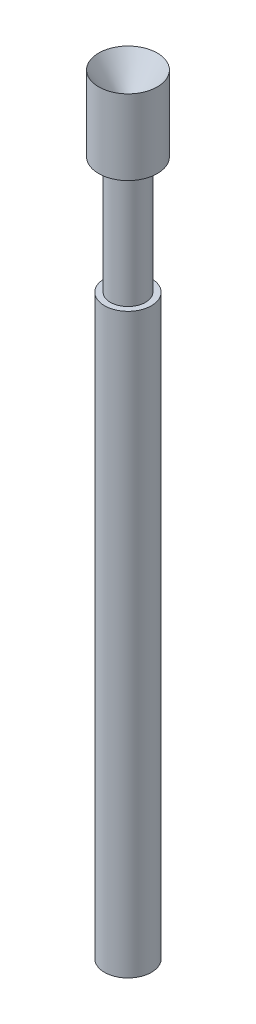
ISO-10303-21;
HEADER;
FILE_DESCRIPTION(('STEP AP214'),'2;1');
FILE_NAME('part.step','',(''),(''),'','','');
FILE_SCHEMA(('AUTOMOTIVE_DESIGN { 1 0 10303 214 1 1 1 1 }'));
ENDSEC;
DATA;
#1=APPLICATION_CONTEXT('core data for automotive mechanical design processes');
#2=APPLICATION_PROTOCOL_DEFINITION('international standard','automotive_design',2000,#1);
#3=PRODUCT_CONTEXT('',#1,'mechanical');
#4=PRODUCT('Part','Part','',(#3));
#5=PRODUCT_RELATED_PRODUCT_CATEGORY('part','',(#4));
#6=PRODUCT_DEFINITION_FORMATION('','',#4);
#7=PRODUCT_DEFINITION_CONTEXT('part definition',#1,'design');
#8=PRODUCT_DEFINITION('design','',#6,#7);
#9=PRODUCT_DEFINITION_SHAPE('','',#8);
#10=(LENGTH_UNIT() NAMED_UNIT(*) SI_UNIT(.MILLI.,.METRE.));
#11=(NAMED_UNIT(*) PLANE_ANGLE_UNIT() SI_UNIT($,.RADIAN.));
#12=(NAMED_UNIT(*) SI_UNIT($,.STERADIAN.) SOLID_ANGLE_UNIT());
#13=UNCERTAINTY_MEASURE_WITH_UNIT(LENGTH_MEASURE(1.E-05),#10,'distance_accuracy_value','');
#14=(GEOMETRIC_REPRESENTATION_CONTEXT(3) GLOBAL_UNCERTAINTY_ASSIGNED_CONTEXT((#13)) GLOBAL_UNIT_ASSIGNED_CONTEXT((#10,
#11,#12)) REPRESENTATION_CONTEXT('',''));
#15=CARTESIAN_POINT('',(0.,0.,0.));
#16=DIRECTION('',(0.,0.,1.));
#17=DIRECTION('',(1.,0.,0.));
#18=AXIS2_PLACEMENT_3D('',#15,#16,#17);
#19=CARTESIAN_POINT('',(0.,0.,0.));
#20=DIRECTION('',(0.,1.,0.));
#21=DIRECTION('',(0.,0.,1.));
#22=AXIS2_PLACEMENT_3D('',#19,#20,#21);
#23=PLANE('',#22);
#24=CARTESIAN_POINT('',(0.,0.,0.));
#25=DIRECTION('',(0.,1.,0.));
#26=DIRECTION('',(0.,0.,1.));
#27=AXIS2_PLACEMENT_3D('',#24,#25,#26);
#28=CIRCLE('',#27,0.508);
#29=CARTESIAN_POINT('',(0.,0.,0.508));
#30=VERTEX_POINT('',#29);
#31=EDGE_CURVE('E10',#30,#30,#28,.T.);
#32=ORIENTED_EDGE('',*,*,#31,.F.);
#33=EDGE_LOOP('',(#32));
#34=FACE_BOUND('',#33,.T.);
#35=ADVANCED_FACE('F33',(#34),#23,.F.);
#36=CARTESIAN_POINT('',(0.,18.2855930036767,0.));
#37=DIRECTION('',(0.,1.,0.));
#38=DIRECTION('',(0.,0.,1.));
#39=AXIS2_PLACEMENT_3D('',#36,#37,#38);
#40=CYLINDRICAL_SURFACE('',#39,0.508000000000001);
#41=CARTESIAN_POINT('',(0.,12.4968,0.));
#42=DIRECTION('',(0.,1.,0.));
#43=DIRECTION('',(0.,0.,1.));
#44=AXIS2_PLACEMENT_3D('',#41,#42,#43);
#45=CIRCLE('',#44,0.508000000000001);
#46=CARTESIAN_POINT('',(0.,12.4968,0.508000000000001));
#47=VERTEX_POINT('',#46);
#48=EDGE_CURVE('E39',#47,#47,#45,.T.);
#49=ORIENTED_EDGE('',*,*,#48,.F.);
#50=EDGE_LOOP('',(#49));
#51=FACE_BOUND('',#50,.T.);
#52=ORIENTED_EDGE('',*,*,#31,.T.);
#53=EDGE_LOOP('',(#52));
#54=FACE_BOUND('',#53,.T.);
#55=ADVANCED_FACE('F94',(#51,#54),#40,.T.);
#56=CARTESIAN_POINT('',(0.508000000000001,12.4968,0.));
#57=DIRECTION('',(0.,-1.,0.));
#58=DIRECTION('',(0.,0.,-1.));
#59=AXIS2_PLACEMENT_3D('',#56,#57,#58);
#60=PLANE('',#59);
#61=CARTESIAN_POINT('',(0.,12.4968,0.));
#62=DIRECTION('',(0.,1.,0.));
#63=DIRECTION('',(0.,0.,1.));
#64=AXIS2_PLACEMENT_3D('',#61,#62,#63);
#65=CIRCLE('',#64,0.381);
#66=CARTESIAN_POINT('',(0.,12.4968,0.381));
#67=VERTEX_POINT('',#66);
#68=EDGE_CURVE('E44',#67,#67,#65,.T.);
#69=ORIENTED_EDGE('',*,*,#68,.F.);
#70=EDGE_LOOP('',(#69));
#71=FACE_BOUND('',#70,.T.);
#72=ORIENTED_EDGE('',*,*,#48,.T.);
#73=EDGE_LOOP('',(#72));
#74=FACE_BOUND('',#73,.T.);
#75=ADVANCED_FACE('F89',(#71,#74),#60,.F.);
#76=CARTESIAN_POINT('',(0.,18.2855930036767,0.));
#77=DIRECTION('',(0.,1.,0.));
#78=DIRECTION('',(0.,0.,1.));
#79=AXIS2_PLACEMENT_3D('',#76,#77,#78);
#80=CYLINDRICAL_SURFACE('',#79,0.381000000000001);
#81=CARTESIAN_POINT('',(0.,15.0368,0.));
#82=DIRECTION('',(0.,1.,0.));
#83=DIRECTION('',(0.,0.,1.));
#84=AXIS2_PLACEMENT_3D('',#81,#82,#83);
#85=CIRCLE('',#84,0.381000000000001);
#86=CARTESIAN_POINT('',(0.,15.0368,0.381000000000001));
#87=VERTEX_POINT('',#86);
#88=EDGE_CURVE('E49',#87,#87,#85,.T.);
#89=ORIENTED_EDGE('',*,*,#88,.F.);
#90=EDGE_LOOP('',(#89));
#91=FACE_BOUND('',#90,.T.);
#92=ORIENTED_EDGE('',*,*,#68,.T.);
#93=EDGE_LOOP('',(#92));
#94=FACE_BOUND('',#93,.T.);
#95=ADVANCED_FACE('F83',(#91,#94),#80,.T.);
#96=CARTESIAN_POINT('',(0.381000000000001,15.0368,0.));
#97=DIRECTION('',(0.,1.,0.));
#98=DIRECTION('',(0.,0.,1.));
#99=AXIS2_PLACEMENT_3D('',#96,#97,#98);
#100=PLANE('',#99);
#101=CARTESIAN_POINT('',(0.,15.0368,0.));
#102=DIRECTION('',(0.,1.,0.));
#103=DIRECTION('',(0.,0.,1.));
#104=AXIS2_PLACEMENT_3D('',#101,#102,#103);
#105=CIRCLE('',#104,0.635);
#106=CARTESIAN_POINT('',(0.,15.0368,0.635));
#107=VERTEX_POINT('',#106);
#108=EDGE_CURVE('E55',#107,#107,#105,.T.);
#109=ORIENTED_EDGE('',*,*,#108,.F.);
#110=EDGE_LOOP('',(#109));
#111=FACE_BOUND('',#110,.T.);
#112=ORIENTED_EDGE('',*,*,#88,.T.);
#113=EDGE_LOOP('',(#112));
#114=FACE_BOUND('',#113,.T.);
#115=ADVANCED_FACE('F77',(#111,#114),#100,.F.);
#116=CARTESIAN_POINT('',(0.,18.2855930036767,0.));
#117=DIRECTION('',(0.,1.,0.));
#118=DIRECTION('',(0.,0.,1.));
#119=AXIS2_PLACEMENT_3D('',#116,#117,#118);
#120=CYLINDRICAL_SURFACE('',#119,0.635);
#121=CARTESIAN_POINT('',(0.,16.6624,0.));
#122=DIRECTION('',(0.,1.,0.));
#123=DIRECTION('',(0.,0.,1.));
#124=AXIS2_PLACEMENT_3D('',#121,#122,#123);
#125=CIRCLE('',#124,0.635);
#126=CARTESIAN_POINT('',(0.,16.6624,0.635));
#127=VERTEX_POINT('',#126);
#128=EDGE_CURVE('E59',#127,#127,#125,.T.);
#129=ORIENTED_EDGE('',*,*,#128,.F.);
#130=EDGE_LOOP('',(#129));
#131=FACE_BOUND('',#130,.T.);
#132=ORIENTED_EDGE('',*,*,#108,.T.);
#133=EDGE_LOOP('',(#132));
#134=FACE_BOUND('',#133,.T.);
#135=ADVANCED_FACE('F71',(#131,#134),#120,.T.);
#136=CARTESIAN_POINT('',(0.,16.6624,0.));
#137=DIRECTION('',(0.,1.,0.));
#138=DIRECTION('',(0.,0.,1.));
#139=AXIS2_PLACEMENT_3D('',#136,#137,#138);
#140=CONICAL_SURFACE('',#139,0.635,0.588002603547569);
#141=CARTESIAN_POINT('',(0.,15.9004,0.));
#142=DIRECTION('',(0.,1.,0.));
#143=DIRECTION('',(0.,0.,1.));
#144=AXIS2_PLACEMENT_3D('',#141,#142,#143);
#145=CIRCLE('',#144,0.127);
#146=CARTESIAN_POINT('',(0.,15.9004,0.127));
#147=VERTEX_POINT('',#146);
#148=EDGE_CURVE('E62',#147,#147,#145,.T.);
#149=ORIENTED_EDGE('',*,*,#148,.F.);
#150=EDGE_LOOP('',(#149));
#151=FACE_BOUND('',#150,.T.);
#152=ORIENTED_EDGE('',*,*,#128,.T.);
#153=EDGE_LOOP('',(#152));
#154=FACE_BOUND('',#153,.T.);
#155=ADVANCED_FACE('F68',(#151,#154),#140,.F.);
#156=CARTESIAN_POINT('',(0.127,15.9004,0.));
#157=DIRECTION('',(0.,-1.,0.));
#158=DIRECTION('',(0.,0.,-1.));
#159=AXIS2_PLACEMENT_3D('',#156,#157,#158);
#160=PLANE('',#159);
#161=ORIENTED_EDGE('',*,*,#148,.T.);
#162=EDGE_LOOP('',(#161));
#163=FACE_BOUND('',#162,.T.);
#164=ADVANCED_FACE('F66',(#163),#160,.F.);
#165=CLOSED_SHELL('',(#35,#55,#75,#95,#115,#135,#155,#164));
#166=MANIFOLD_SOLID_BREP('B2',#165);
#167=ADVANCED_BREP_SHAPE_REPRESENTATION('',(#18,#166),#14);
#168=SHAPE_DEFINITION_REPRESENTATION(#9,#167);
ENDSEC;
END-ISO-10303-21;
